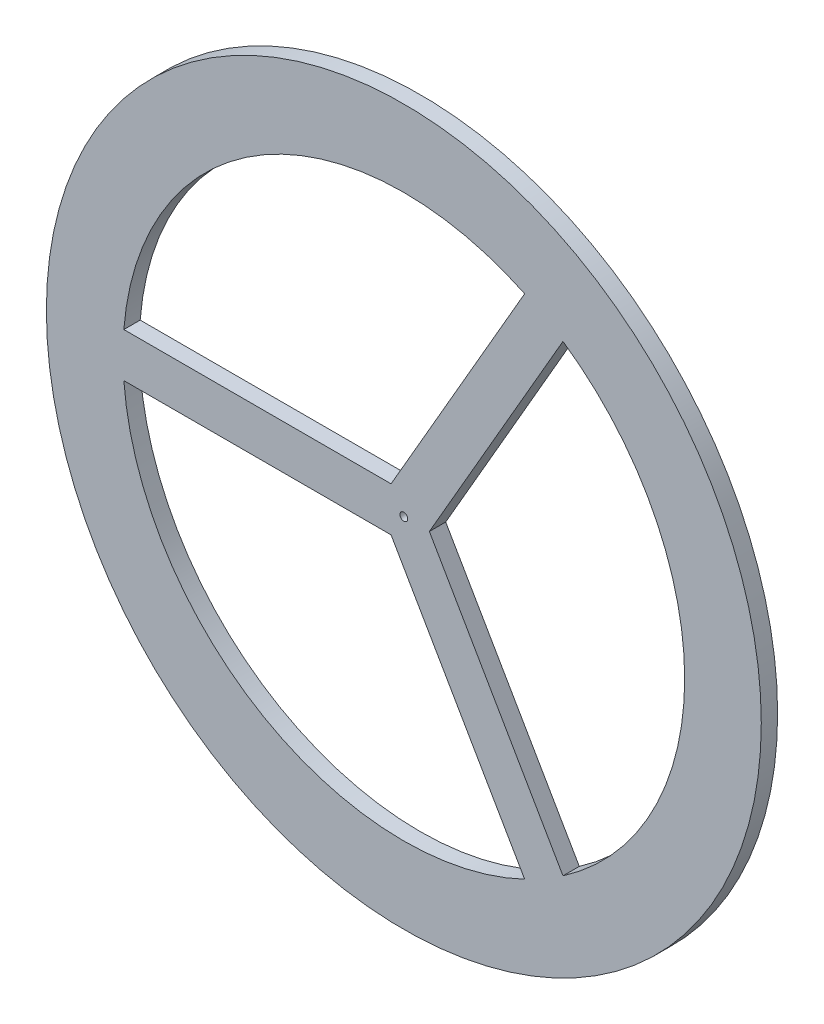
ISO-10303-21;
HEADER;
FILE_DESCRIPTION(('STEP AP214'),'2;1');
FILE_NAME('part.step','',(''),(''),'','','');
FILE_SCHEMA(('AUTOMOTIVE_DESIGN { 1 0 10303 214 1 1 1 1 }'));
ENDSEC;
DATA;
#1=APPLICATION_CONTEXT('core data for automotive mechanical design processes');
#2=APPLICATION_PROTOCOL_DEFINITION('international standard','automotive_design',2000,#1);
#3=PRODUCT_CONTEXT('',#1,'mechanical');
#4=PRODUCT('Part','Part','',(#3));
#5=PRODUCT_RELATED_PRODUCT_CATEGORY('part','',(#4));
#6=PRODUCT_DEFINITION_FORMATION('','',#4);
#7=PRODUCT_DEFINITION_CONTEXT('part definition',#1,'design');
#8=PRODUCT_DEFINITION('design','',#6,#7);
#9=PRODUCT_DEFINITION_SHAPE('','',#8);
#10=(LENGTH_UNIT() NAMED_UNIT(*) SI_UNIT(.MILLI.,.METRE.));
#11=(NAMED_UNIT(*) PLANE_ANGLE_UNIT() SI_UNIT($,.RADIAN.));
#12=(NAMED_UNIT(*) SI_UNIT($,.STERADIAN.) SOLID_ANGLE_UNIT());
#13=UNCERTAINTY_MEASURE_WITH_UNIT(LENGTH_MEASURE(1.E-05),#10,'distance_accuracy_value','');
#14=(GEOMETRIC_REPRESENTATION_CONTEXT(3) GLOBAL_UNCERTAINTY_ASSIGNED_CONTEXT((#13)) GLOBAL_UNIT_ASSIGNED_CONTEXT((#10,
#11,#12)) REPRESENTATION_CONTEXT('',''));
#15=CARTESIAN_POINT('',(0.,0.,0.));
#16=DIRECTION('',(0.,0.,1.));
#17=DIRECTION('',(1.,0.,0.));
#18=AXIS2_PLACEMENT_3D('',#15,#16,#17);
#19=CARTESIAN_POINT('',(0.,0.,8.));
#20=DIRECTION('',(0.,0.,1.));
#21=DIRECTION('',(1.,0.,0.));
#22=AXIS2_PLACEMENT_3D('',#19,#20,#21);
#23=PLANE('',#22);
#24=CARTESIAN_POINT('',(0.,0.,8.));
#25=DIRECTION('',(0.,0.,1.));
#26=DIRECTION('',(1.,0.,0.));
#27=AXIS2_PLACEMENT_3D('',#24,#25,#26);
#28=CIRCLE('',#27,1.9);
#29=CARTESIAN_POINT('',(1.9,0.,8.));
#30=VERTEX_POINT('',#29);
#31=EDGE_CURVE('E327',#30,#30,#28,.T.);
#32=ORIENTED_EDGE('',*,*,#31,.F.);
#33=EDGE_LOOP('',(#32));
#34=FACE_BOUND('',#33,.T.);
#35=CARTESIAN_POINT('',(0.,0.,8.));
#36=DIRECTION('',(0.,0.,1.));
#37=DIRECTION('',(1.,0.,0.));
#38=AXIS2_PLACEMENT_3D('',#35,#36,#37);
#39=CIRCLE('',#38,175.);
#40=CARTESIAN_POINT('',(175.,0.,8.));
#41=VERTEX_POINT('',#40);
#42=EDGE_CURVE('E11',#41,#41,#39,.T.);
#43=ORIENTED_EDGE('',*,*,#42,.T.);
#44=EDGE_LOOP('',(#43));
#45=FACE_BOUND('',#44,.T.);
#46=CARTESIAN_POINT('',(0.,0.,8.));
#47=DIRECTION('',(0.,0.,1.));
#48=DIRECTION('',(1.,0.,0.));
#49=AXIS2_PLACEMENT_3D('',#46,#47,#48);
#50=CIRCLE('',#49,137.5);
#51=CARTESIAN_POINT('',(59.1616006233165,124.121533231294,8.));
#52=VERTEX_POINT('',#51);
#53=CARTESIAN_POINT('',(-137.073201246633,10.8253175473056,8.));
#54=VERTEX_POINT('',#53);
#55=EDGE_CURVE('E161',#52,#54,#50,.T.);
#56=ORIENTED_EDGE('',*,*,#55,.F.);
#57=DIRECTION('',(0.499999999999999,0.866025403784439,0.));
#58=VECTOR('',#57,1.);
#59=CARTESIAN_POINT('',(-6.25,10.8253175473055,8.));
#60=LINE('',#59,#58);
#61=CARTESIAN_POINT('',(-6.25,10.8253175473055,8.));
#62=VERTEX_POINT('',#61);
#63=EDGE_CURVE('E159',#62,#52,#60,.T.);
#64=ORIENTED_EDGE('',*,*,#63,.F.);
#65=DIRECTION('',(1.,0.,0.));
#66=VECTOR('',#65,1.);
#67=CARTESIAN_POINT('',(-6.25,10.8253175473055,8.));
#68=LINE('',#67,#66);
#69=EDGE_CURVE('E165',#54,#62,#68,.T.);
#70=ORIENTED_EDGE('',*,*,#69,.F.);
#71=EDGE_LOOP('',(#56,#64,#70));
#72=FACE_BOUND('',#71,.T.);
#73=DIRECTION('',(-1.,0.,0.));
#74=VECTOR('',#73,1.);
#75=CARTESIAN_POINT('',(-6.25,-10.8253175473055,8.));
#76=LINE('',#75,#74);
#77=CARTESIAN_POINT('',(-6.25,-10.8253175473055,8.));
#78=VERTEX_POINT('',#77);
#79=CARTESIAN_POINT('',(-137.073201246633,-10.8253175473056,8.));
#80=VERTEX_POINT('',#79);
#81=EDGE_CURVE('E137',#78,#80,#76,.T.);
#82=ORIENTED_EDGE('',*,*,#81,.F.);
#83=DIRECTION('',(-0.5,0.866025403784439,0.));
#84=VECTOR('',#83,1.);
#85=CARTESIAN_POINT('',(-6.25,-10.8253175473055,8.));
#86=LINE('',#85,#84);
#87=CARTESIAN_POINT('',(59.1616006233166,-124.121533231294,8.));
#88=VERTEX_POINT('',#87);
#89=EDGE_CURVE('E135',#88,#78,#86,.T.);
#90=ORIENTED_EDGE('',*,*,#89,.F.);
#91=CARTESIAN_POINT('',(0.,0.,8.));
#92=DIRECTION('',(0.,0.,1.));
#93=DIRECTION('',(1.,0.,0.));
#94=AXIS2_PLACEMENT_3D('',#91,#92,#93);
#95=CIRCLE('',#94,137.5);
#96=EDGE_CURVE('E141',#80,#88,#95,.T.);
#97=ORIENTED_EDGE('',*,*,#96,.F.);
#98=EDGE_LOOP('',(#82,#90,#97));
#99=FACE_BOUND('',#98,.T.);
#100=CARTESIAN_POINT('',(0.,0.,8.));
#101=DIRECTION('',(0.,0.,1.));
#102=DIRECTION('',(1.,0.,0.));
#103=AXIS2_PLACEMENT_3D('',#100,#101,#102);
#104=CIRCLE('',#103,137.5);
#105=CARTESIAN_POINT('',(77.9116006233167,-113.296215683988,8.));
#106=VERTEX_POINT('',#105);
#107=CARTESIAN_POINT('',(77.9116006233166,113.296215683988,8.));
#108=VERTEX_POINT('',#107);
#109=EDGE_CURVE('E115',#106,#108,#104,.T.);
#110=ORIENTED_EDGE('',*,*,#109,.F.);
#111=DIRECTION('',(0.500000000000001,-0.866025403784438,0.));
#112=VECTOR('',#111,1.);
#113=CARTESIAN_POINT('',(12.5,0.,8.));
#114=LINE('',#113,#112);
#115=CARTESIAN_POINT('',(12.5,0.,8.));
#116=VERTEX_POINT('',#115);
#117=EDGE_CURVE('E107',#116,#106,#114,.T.);
#118=ORIENTED_EDGE('',*,*,#117,.F.);
#119=DIRECTION('',(-0.500000000000001,-0.866025403784438,0.));
#120=VECTOR('',#119,1.);
#121=CARTESIAN_POINT('',(12.5,0.,8.));
#122=LINE('',#121,#120);
#123=EDGE_CURVE('E124',#108,#116,#122,.T.);
#124=ORIENTED_EDGE('',*,*,#123,.F.);
#125=EDGE_LOOP('',(#110,#118,#124));
#126=FACE_BOUND('',#125,.T.);
#127=ADVANCED_FACE('F34',(#34,#45,#72,#99,#126),#23,.T.);
#128=CARTESIAN_POINT('',(0.,0.,0.));
#129=DIRECTION('',(0.,0.,1.));
#130=DIRECTION('',(1.,0.,0.));
#131=AXIS2_PLACEMENT_3D('',#128,#129,#130);
#132=PLANE('',#131);
#133=CARTESIAN_POINT('',(0.,0.,0.));
#134=DIRECTION('',(0.,0.,1.));
#135=DIRECTION('',(1.,0.,0.));
#136=AXIS2_PLACEMENT_3D('',#133,#134,#135);
#137=CIRCLE('',#136,1.9);
#138=CARTESIAN_POINT('',(1.9,0.,0.));
#139=VERTEX_POINT('',#138);
#140=EDGE_CURVE('E38',#139,#139,#137,.T.);
#141=ORIENTED_EDGE('',*,*,#140,.T.);
#142=EDGE_LOOP('',(#141));
#143=FACE_BOUND('',#142,.T.);
#144=DIRECTION('',(-0.5,0.866025403784439,0.));
#145=VECTOR('',#144,1.);
#146=CARTESIAN_POINT('',(-6.25,-10.8253175473055,0.));
#147=LINE('',#146,#145);
#148=CARTESIAN_POINT('',(59.1616006233166,-124.121533231294,0.));
#149=VERTEX_POINT('',#148);
#150=CARTESIAN_POINT('',(-6.25,-10.8253175473055,0.));
#151=VERTEX_POINT('',#150);
#152=EDGE_CURVE('E122',#149,#151,#147,.T.);
#153=ORIENTED_EDGE('',*,*,#152,.T.);
#154=DIRECTION('',(-1.,0.,0.));
#155=VECTOR('',#154,1.);
#156=CARTESIAN_POINT('',(-6.25,-10.8253175473055,0.));
#157=LINE('',#156,#155);
#158=CARTESIAN_POINT('',(-137.073201246633,-10.8253175473056,0.));
#159=VERTEX_POINT('',#158);
#160=EDGE_CURVE('E146',#151,#159,#157,.T.);
#161=ORIENTED_EDGE('',*,*,#160,.T.);
#162=CARTESIAN_POINT('',(0.,0.,0.));
#163=DIRECTION('',(0.,0.,1.));
#164=DIRECTION('',(1.,0.,0.));
#165=AXIS2_PLACEMENT_3D('',#162,#163,#164);
#166=CIRCLE('',#165,137.5);
#167=EDGE_CURVE('E138',#159,#149,#166,.T.);
#168=ORIENTED_EDGE('',*,*,#167,.T.);
#169=EDGE_LOOP('',(#153,#161,#168));
#170=FACE_BOUND('',#169,.T.);
#171=CARTESIAN_POINT('',(0.,0.,0.));
#172=DIRECTION('',(0.,0.,1.));
#173=DIRECTION('',(1.,0.,0.));
#174=AXIS2_PLACEMENT_3D('',#171,#172,#173);
#175=CIRCLE('',#174,175.);
#176=CARTESIAN_POINT('',(175.,0.,0.));
#177=VERTEX_POINT('',#176);
#178=EDGE_CURVE('E43',#177,#177,#175,.T.);
#179=ORIENTED_EDGE('',*,*,#178,.F.);
#180=EDGE_LOOP('',(#179));
#181=FACE_BOUND('',#180,.T.);
#182=DIRECTION('',(0.499999999999999,0.866025403784439,0.));
#183=VECTOR('',#182,1.);
#184=CARTESIAN_POINT('',(-6.25,10.8253175473055,0.));
#185=LINE('',#184,#183);
#186=CARTESIAN_POINT('',(-6.25,10.8253175473055,0.));
#187=VERTEX_POINT('',#186);
#188=CARTESIAN_POINT('',(59.1616006233165,124.121533231294,0.));
#189=VERTEX_POINT('',#188);
#190=EDGE_CURVE('E158',#187,#189,#185,.T.);
#191=ORIENTED_EDGE('',*,*,#190,.T.);
#192=CARTESIAN_POINT('',(0.,0.,0.));
#193=DIRECTION('',(0.,0.,1.));
#194=DIRECTION('',(1.,0.,0.));
#195=AXIS2_PLACEMENT_3D('',#192,#193,#194);
#196=CIRCLE('',#195,137.5);
#197=CARTESIAN_POINT('',(-137.073201246633,10.8253175473056,0.));
#198=VERTEX_POINT('',#197);
#199=EDGE_CURVE('E170',#189,#198,#196,.T.);
#200=ORIENTED_EDGE('',*,*,#199,.T.);
#201=DIRECTION('',(1.,0.,0.));
#202=VECTOR('',#201,1.);
#203=CARTESIAN_POINT('',(-6.25,10.8253175473055,0.));
#204=LINE('',#203,#202);
#205=EDGE_CURVE('E162',#198,#187,#204,.T.);
#206=ORIENTED_EDGE('',*,*,#205,.T.);
#207=EDGE_LOOP('',(#191,#200,#206));
#208=FACE_BOUND('',#207,.T.);
#209=DIRECTION('',(0.500000000000001,-0.866025403784438,0.));
#210=VECTOR('',#209,1.);
#211=CARTESIAN_POINT('',(12.5,0.,0.));
#212=LINE('',#211,#210);
#213=CARTESIAN_POINT('',(12.5,0.,0.));
#214=VERTEX_POINT('',#213);
#215=CARTESIAN_POINT('',(77.9116006233167,-113.296215683988,0.));
#216=VERTEX_POINT('',#215);
#217=EDGE_CURVE('E59',#214,#216,#212,.T.);
#218=ORIENTED_EDGE('',*,*,#217,.T.);
#219=CARTESIAN_POINT('',(0.,0.,0.));
#220=DIRECTION('',(0.,0.,1.));
#221=DIRECTION('',(1.,0.,0.));
#222=AXIS2_PLACEMENT_3D('',#219,#220,#221);
#223=CIRCLE('',#222,137.5);
#224=CARTESIAN_POINT('',(77.9116006233167,113.296215683988,0.));
#225=VERTEX_POINT('',#224);
#226=EDGE_CURVE('E121',#216,#225,#223,.T.);
#227=ORIENTED_EDGE('',*,*,#226,.T.);
#228=DIRECTION('',(-0.500000000000001,-0.866025403784438,0.));
#229=VECTOR('',#228,1.);
#230=CARTESIAN_POINT('',(12.5,0.,0.));
#231=LINE('',#230,#229);
#232=EDGE_CURVE('E116',#225,#214,#231,.T.);
#233=ORIENTED_EDGE('',*,*,#232,.T.);
#234=EDGE_LOOP('',(#218,#227,#233));
#235=FACE_BOUND('',#234,.T.);
#236=ADVANCED_FACE('F185',(#143,#170,#181,#208,#235),#132,.F.);
#237=CARTESIAN_POINT('',(0.,0.,8.));
#238=DIRECTION('',(0.,0.,-1.));
#239=DIRECTION('',(-1.,0.,0.));
#240=AXIS2_PLACEMENT_3D('',#237,#238,#239);
#241=CYLINDRICAL_SURFACE('',#240,175.);
#242=ORIENTED_EDGE('',*,*,#42,.F.);
#243=EDGE_LOOP('',(#242));
#244=FACE_BOUND('',#243,.T.);
#245=ORIENTED_EDGE('',*,*,#178,.T.);
#246=EDGE_LOOP('',(#245));
#247=FACE_BOUND('',#246,.T.);
#248=ADVANCED_FACE('F36',(#244,#247),#241,.T.);
#249=CARTESIAN_POINT('',(-6.25,10.8253175473055,8.));
#250=DIRECTION('',(-0.866025403784439,0.499999999999999,0.));
#251=DIRECTION('',(-0.499999999999999,-0.866025403784439,0.));
#252=AXIS2_PLACEMENT_3D('',#249,#250,#251);
#253=PLANE('',#252);
#254=ORIENTED_EDGE('',*,*,#190,.F.);
#255=DIRECTION('',(0.,0.,-1.));
#256=VECTOR('',#255,1.);
#257=CARTESIAN_POINT('',(-6.25,10.8253175473055,8.));
#258=LINE('',#257,#256);
#259=EDGE_CURVE('E167',#62,#187,#258,.T.);
#260=ORIENTED_EDGE('',*,*,#259,.F.);
#261=ORIENTED_EDGE('',*,*,#63,.T.);
#262=DIRECTION('',(0.,0.,-1.));
#263=VECTOR('',#262,1.);
#264=CARTESIAN_POINT('',(59.1616006233165,124.121533231294,8.));
#265=LINE('',#264,#263);
#266=EDGE_CURVE('E179',#52,#189,#265,.T.);
#267=ORIENTED_EDGE('',*,*,#266,.T.);
#268=EDGE_LOOP('',(#254,#260,#261,#267));
#269=FACE_BOUND('',#268,.T.);
#270=ADVANCED_FACE('F209',(#269),#253,.T.);
#271=CARTESIAN_POINT('',(0.,0.,8.));
#272=DIRECTION('',(0.,0.,-1.));
#273=DIRECTION('',(-1.,0.,0.));
#274=AXIS2_PLACEMENT_3D('',#271,#272,#273);
#275=CYLINDRICAL_SURFACE('',#274,137.5);
#276=ORIENTED_EDGE('',*,*,#199,.F.);
#277=ORIENTED_EDGE('',*,*,#266,.F.);
#278=ORIENTED_EDGE('',*,*,#55,.T.);
#279=DIRECTION('',(0.,0.,-1.));
#280=VECTOR('',#279,1.);
#281=CARTESIAN_POINT('',(-137.073201246633,10.8253175473056,8.));
#282=LINE('',#281,#280);
#283=EDGE_CURVE('E177',#54,#198,#282,.T.);
#284=ORIENTED_EDGE('',*,*,#283,.T.);
#285=EDGE_LOOP('',(#276,#277,#278,#284));
#286=FACE_BOUND('',#285,.T.);
#287=ADVANCED_FACE('F212',(#286),#275,.F.);
#288=CARTESIAN_POINT('',(-6.25,10.8253175473055,8.));
#289=DIRECTION('',(0.,1.,0.));
#290=DIRECTION('',(-1.,0.,0.));
#291=AXIS2_PLACEMENT_3D('',#288,#289,#290);
#292=PLANE('',#291);
#293=ORIENTED_EDGE('',*,*,#205,.F.);
#294=ORIENTED_EDGE('',*,*,#283,.F.);
#295=ORIENTED_EDGE('',*,*,#69,.T.);
#296=ORIENTED_EDGE('',*,*,#259,.T.);
#297=EDGE_LOOP('',(#293,#294,#295,#296));
#298=FACE_BOUND('',#297,.T.);
#299=ADVANCED_FACE('F216',(#298),#292,.T.);
#300=CARTESIAN_POINT('',(-6.25,-10.8253175473055,8.));
#301=DIRECTION('',(-0.866025403784439,-0.5,0.));
#302=DIRECTION('',(0.5,-0.866025403784439,0.));
#303=AXIS2_PLACEMENT_3D('',#300,#301,#302);
#304=PLANE('',#303);
#305=ORIENTED_EDGE('',*,*,#152,.F.);
#306=DIRECTION('',(0.,0.,-1.));
#307=VECTOR('',#306,1.);
#308=CARTESIAN_POINT('',(59.1616006233166,-124.121533231294,8.));
#309=LINE('',#308,#307);
#310=EDGE_CURVE('E143',#88,#149,#309,.T.);
#311=ORIENTED_EDGE('',*,*,#310,.F.);
#312=ORIENTED_EDGE('',*,*,#89,.T.);
#313=DIRECTION('',(0.,0.,-1.));
#314=VECTOR('',#313,1.);
#315=CARTESIAN_POINT('',(-6.25,-10.8253175473055,8.));
#316=LINE('',#315,#314);
#317=EDGE_CURVE('E155',#78,#151,#316,.T.);
#318=ORIENTED_EDGE('',*,*,#317,.T.);
#319=EDGE_LOOP('',(#305,#311,#312,#318));
#320=FACE_BOUND('',#319,.T.);
#321=ADVANCED_FACE('F220',(#320),#304,.T.);
#322=CARTESIAN_POINT('',(-6.25,-10.8253175473055,8.));
#323=DIRECTION('',(0.,-1.,0.));
#324=DIRECTION('',(1.,0.,0.));
#325=AXIS2_PLACEMENT_3D('',#322,#323,#324);
#326=PLANE('',#325);
#327=ORIENTED_EDGE('',*,*,#160,.F.);
#328=ORIENTED_EDGE('',*,*,#317,.F.);
#329=ORIENTED_EDGE('',*,*,#81,.T.);
#330=DIRECTION('',(0.,0.,-1.));
#331=VECTOR('',#330,1.);
#332=CARTESIAN_POINT('',(-137.073201246633,-10.8253175473056,8.));
#333=LINE('',#332,#331);
#334=EDGE_CURVE('E153',#80,#159,#333,.T.);
#335=ORIENTED_EDGE('',*,*,#334,.T.);
#336=EDGE_LOOP('',(#327,#328,#329,#335));
#337=FACE_BOUND('',#336,.T.);
#338=ADVANCED_FACE('F224',(#337),#326,.T.);
#339=CARTESIAN_POINT('',(0.,0.,8.));
#340=DIRECTION('',(0.,0.,-1.));
#341=DIRECTION('',(-1.,0.,0.));
#342=AXIS2_PLACEMENT_3D('',#339,#340,#341);
#343=CYLINDRICAL_SURFACE('',#342,137.5);
#344=ORIENTED_EDGE('',*,*,#167,.F.);
#345=ORIENTED_EDGE('',*,*,#334,.F.);
#346=ORIENTED_EDGE('',*,*,#96,.T.);
#347=ORIENTED_EDGE('',*,*,#310,.T.);
#348=EDGE_LOOP('',(#344,#345,#346,#347));
#349=FACE_BOUND('',#348,.T.);
#350=ADVANCED_FACE('F228',(#349),#343,.F.);
#351=CARTESIAN_POINT('',(12.5,0.,8.));
#352=DIRECTION('',(0.866025403784438,0.500000000000001,0.));
#353=DIRECTION('',(-0.500000000000001,0.866025403784438,0.));
#354=AXIS2_PLACEMENT_3D('',#351,#352,#353);
#355=PLANE('',#354);
#356=ORIENTED_EDGE('',*,*,#217,.F.);
#357=DIRECTION('',(0.,0.,-1.));
#358=VECTOR('',#357,1.);
#359=CARTESIAN_POINT('',(12.5,0.,8.));
#360=LINE('',#359,#358);
#361=EDGE_CURVE('E111',#116,#214,#360,.T.);
#362=ORIENTED_EDGE('',*,*,#361,.F.);
#363=ORIENTED_EDGE('',*,*,#117,.T.);
#364=DIRECTION('',(0.,0.,-1.));
#365=VECTOR('',#364,1.);
#366=CARTESIAN_POINT('',(77.9116006233167,-113.296215683988,8.));
#367=LINE('',#366,#365);
#368=EDGE_CURVE('E110',#106,#216,#367,.T.);
#369=ORIENTED_EDGE('',*,*,#368,.T.);
#370=EDGE_LOOP('',(#356,#362,#363,#369));
#371=FACE_BOUND('',#370,.T.);
#372=ADVANCED_FACE('F109',(#371),#355,.T.);
#373=CARTESIAN_POINT('',(0.,0.,8.));
#374=DIRECTION('',(0.,0.,-1.));
#375=DIRECTION('',(-1.,0.,0.));
#376=AXIS2_PLACEMENT_3D('',#373,#374,#375);
#377=CYLINDRICAL_SURFACE('',#376,137.5);
#378=ORIENTED_EDGE('',*,*,#226,.F.);
#379=ORIENTED_EDGE('',*,*,#368,.F.);
#380=ORIENTED_EDGE('',*,*,#109,.T.);
#381=DIRECTION('',(0.,0.,-1.));
#382=VECTOR('',#381,1.);
#383=CARTESIAN_POINT('',(77.9116006233167,113.296215683988,8.));
#384=LINE('',#383,#382);
#385=EDGE_CURVE('E51',#108,#225,#384,.T.);
#386=ORIENTED_EDGE('',*,*,#385,.T.);
#387=EDGE_LOOP('',(#378,#379,#380,#386));
#388=FACE_BOUND('',#387,.T.);
#389=ADVANCED_FACE('F119',(#388),#377,.F.);
#390=CARTESIAN_POINT('',(12.5,0.,8.));
#391=DIRECTION('',(0.866025403784438,-0.500000000000001,0.));
#392=DIRECTION('',(0.500000000000001,0.866025403784438,0.));
#393=AXIS2_PLACEMENT_3D('',#390,#391,#392);
#394=PLANE('',#393);
#395=ORIENTED_EDGE('',*,*,#232,.F.);
#396=ORIENTED_EDGE('',*,*,#385,.F.);
#397=ORIENTED_EDGE('',*,*,#123,.T.);
#398=ORIENTED_EDGE('',*,*,#361,.T.);
#399=EDGE_LOOP('',(#395,#396,#397,#398));
#400=FACE_BOUND('',#399,.T.);
#401=ADVANCED_FACE('F190',(#400),#394,.T.);
#402=CARTESIAN_POINT('',(0.,0.,-1.2E-05));
#403=DIRECTION('',(0.,0.,1.));
#404=DIRECTION('',(1.,0.,0.));
#405=AXIS2_PLACEMENT_3D('',#402,#403,#404);
#406=CYLINDRICAL_SURFACE('',#405,1.9);
#407=ORIENTED_EDGE('',*,*,#31,.T.);
#408=EDGE_LOOP('',(#407));
#409=FACE_BOUND('',#408,.T.);
#410=ORIENTED_EDGE('',*,*,#140,.F.);
#411=EDGE_LOOP('',(#410));
#412=FACE_BOUND('',#411,.T.);
#413=ADVANCED_FACE('F192',(#409,#412),#406,.F.);
#414=CLOSED_SHELL('',(#127,#236,#248,#270,#287,#299,#321,#338,#350,#372,#389,#401,#413));
#415=MANIFOLD_SOLID_BREP('B2',#414);
#416=ADVANCED_BREP_SHAPE_REPRESENTATION('',(#18,#415),#14);
#417=SHAPE_DEFINITION_REPRESENTATION(#9,#416);
ENDSEC;
END-ISO-10303-21;
